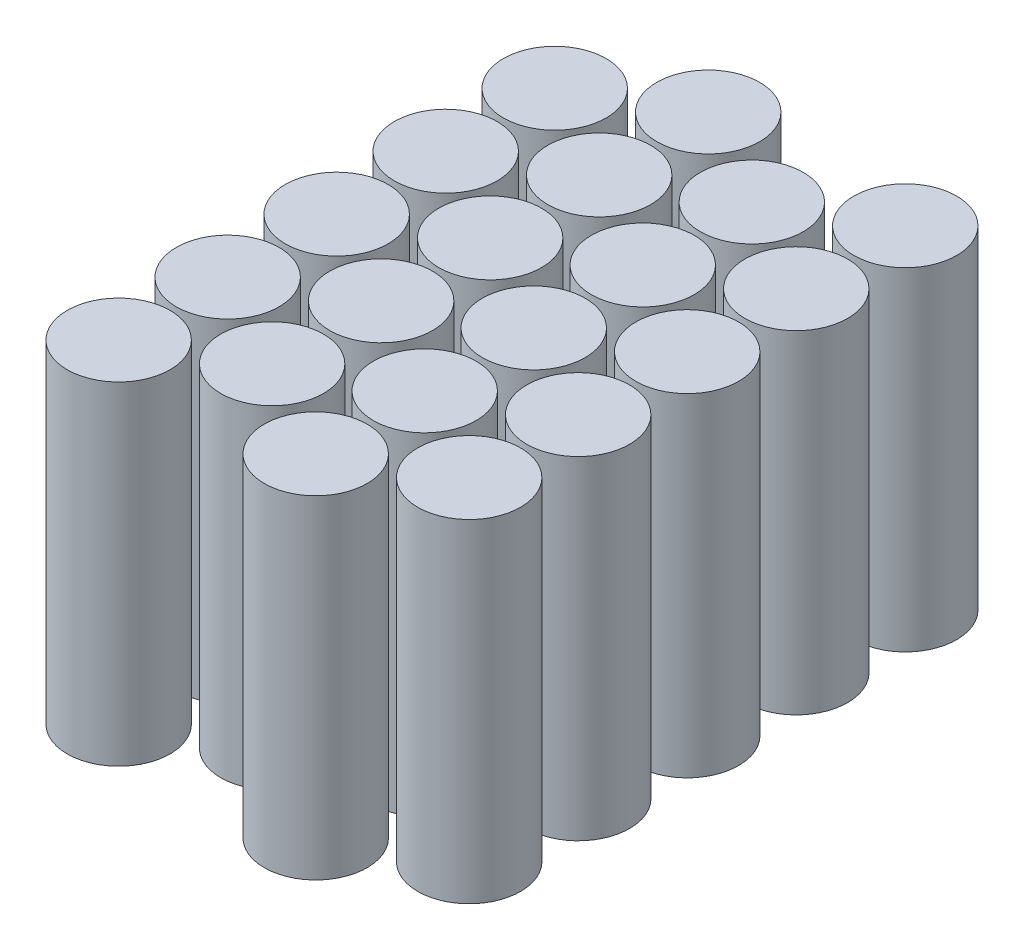
ISO-10303-21;
HEADER;
FILE_DESCRIPTION(('STEP AP214'),'2;1');
FILE_NAME('part.step','',(''),(''),'','','');
FILE_SCHEMA(('AUTOMOTIVE_DESIGN { 1 0 10303 214 1 1 1 1 }'));
ENDSEC;
DATA;
#1=APPLICATION_CONTEXT('core data for automotive mechanical design processes');
#2=APPLICATION_PROTOCOL_DEFINITION('international standard','automotive_design',2000,#1);
#3=PRODUCT_CONTEXT('',#1,'mechanical');
#4=PRODUCT('Part','Part','',(#3));
#5=PRODUCT_RELATED_PRODUCT_CATEGORY('part','',(#4));
#6=PRODUCT_DEFINITION_FORMATION('','',#4);
#7=PRODUCT_DEFINITION_CONTEXT('part definition',#1,'design');
#8=PRODUCT_DEFINITION('design','',#6,#7);
#9=PRODUCT_DEFINITION_SHAPE('','',#8);
#10=(LENGTH_UNIT() NAMED_UNIT(*) SI_UNIT(.MILLI.,.METRE.));
#11=(NAMED_UNIT(*) PLANE_ANGLE_UNIT() SI_UNIT($,.RADIAN.));
#12=(NAMED_UNIT(*) SI_UNIT($,.STERADIAN.) SOLID_ANGLE_UNIT());
#13=UNCERTAINTY_MEASURE_WITH_UNIT(LENGTH_MEASURE(1.E-05),#10,'distance_accuracy_value','');
#14=(GEOMETRIC_REPRESENTATION_CONTEXT(3) GLOBAL_UNCERTAINTY_ASSIGNED_CONTEXT((#13)) GLOBAL_UNIT_ASSIGNED_CONTEXT((#10,
#11,#12)) REPRESENTATION_CONTEXT('',''));
#15=CARTESIAN_POINT('',(0.,0.,0.));
#16=DIRECTION('',(0.,0.,1.));
#17=DIRECTION('',(1.,0.,0.));
#18=AXIS2_PLACEMENT_3D('',#15,#16,#17);
#19=CARTESIAN_POINT('',(62.0948020696912,35.1,80.15));
#20=DIRECTION('',(0.,-1.,0.));
#21=DIRECTION('',(0.,0.,-1.));
#22=AXIS2_PLACEMENT_3D('',#19,#20,#21);
#23=CYLINDRICAL_SURFACE('',#22,10.85);
#24=CARTESIAN_POINT('',(62.0948020696912,35.1,80.15));
#25=DIRECTION('',(0.,1.,0.));
#26=DIRECTION('',(0.,0.,1.));
#27=AXIS2_PLACEMENT_3D('',#24,#25,#26);
#28=CIRCLE('',#27,10.85);
#29=CARTESIAN_POINT('',(62.0948020696912,35.1,91.));
#30=VERTEX_POINT('',#29);
#31=EDGE_CURVE('E61',#30,#30,#28,.T.);
#32=ORIENTED_EDGE('',*,*,#31,.F.);
#33=EDGE_LOOP('',(#32));
#34=FACE_BOUND('',#33,.T.);
#35=CARTESIAN_POINT('',(62.0948020696912,-35.1,80.15));
#36=DIRECTION('',(0.,1.,0.));
#37=DIRECTION('',(0.,0.,1.));
#38=AXIS2_PLACEMENT_3D('',#35,#36,#37);
#39=CIRCLE('',#38,10.85);
#40=CARTESIAN_POINT('',(62.0948020696912,-35.1,91.));
#41=VERTEX_POINT('',#40);
#42=EDGE_CURVE('E12',#41,#41,#39,.T.);
#43=ORIENTED_EDGE('',*,*,#42,.T.);
#44=EDGE_LOOP('',(#43));
#45=FACE_BOUND('',#44,.T.);
#46=ADVANCED_FACE('F57',(#34,#45),#23,.T.);
#47=CARTESIAN_POINT('',(62.0948020696912,35.1,80.15));
#48=DIRECTION('',(0.,1.,0.));
#49=DIRECTION('',(0.,0.,1.));
#50=AXIS2_PLACEMENT_3D('',#47,#48,#49);
#51=PLANE('',#50);
#52=ORIENTED_EDGE('',*,*,#31,.T.);
#53=EDGE_LOOP('',(#52));
#54=FACE_BOUND('',#53,.T.);
#55=ADVANCED_FACE('F59',(#54),#51,.T.);
#56=CARTESIAN_POINT('',(62.0948020696912,-35.1,80.15));
#57=DIRECTION('',(0.,1.,0.));
#58=DIRECTION('',(0.,0.,1.));
#59=AXIS2_PLACEMENT_3D('',#56,#57,#58);
#60=PLANE('',#59);
#61=ORIENTED_EDGE('',*,*,#42,.F.);
#62=EDGE_LOOP('',(#61));
#63=FACE_BOUND('',#62,.T.);
#64=ADVANCED_FACE('F76',(#63),#60,.F.);
#65=CLOSED_SHELL('',(#46,#55,#64));
#66=MANIFOLD_SOLID_BREP('B2',#65);
#67=CARTESIAN_POINT('',(41.57,35.1,92.));
#68=DIRECTION('',(0.,-1.,0.));
#69=DIRECTION('',(0.,0.,-1.));
#70=AXIS2_PLACEMENT_3D('',#67,#68,#69);
#71=CYLINDRICAL_SURFACE('',#70,10.85);
#72=CARTESIAN_POINT('',(41.57,35.1,92.));
#73=DIRECTION('',(0.,1.,0.));
#74=DIRECTION('',(0.,0.,1.));
#75=AXIS2_PLACEMENT_3D('',#72,#73,#74);
#76=CIRCLE('',#75,10.85);
#77=CARTESIAN_POINT('',(41.57,35.1,102.85));
#78=VERTEX_POINT('',#77);
#79=EDGE_CURVE('E56',#78,#78,#76,.T.);
#80=ORIENTED_EDGE('',*,*,#79,.F.);
#81=EDGE_LOOP('',(#80));
#82=FACE_BOUND('',#81,.T.);
#83=CARTESIAN_POINT('',(41.57,-35.1,92.));
#84=DIRECTION('',(0.,1.,0.));
#85=DIRECTION('',(0.,0.,1.));
#86=AXIS2_PLACEMENT_3D('',#83,#84,#85);
#87=CIRCLE('',#86,10.85);
#88=CARTESIAN_POINT('',(41.57,-35.1,102.85));
#89=VERTEX_POINT('',#88);
#90=EDGE_CURVE('E114',#89,#89,#87,.T.);
#91=ORIENTED_EDGE('',*,*,#90,.T.);
#92=EDGE_LOOP('',(#91));
#93=FACE_BOUND('',#92,.T.);
#94=ADVANCED_FACE('F111',(#82,#93),#71,.T.);
#95=CARTESIAN_POINT('',(41.57,35.1,92.));
#96=DIRECTION('',(0.,1.,0.));
#97=DIRECTION('',(0.,0.,1.));
#98=AXIS2_PLACEMENT_3D('',#95,#96,#97);
#99=PLANE('',#98);
#100=ORIENTED_EDGE('',*,*,#79,.T.);
#101=EDGE_LOOP('',(#100));
#102=FACE_BOUND('',#101,.T.);
#103=ADVANCED_FACE('F127',(#102),#99,.T.);
#104=CARTESIAN_POINT('',(41.57,-35.1,92.));
#105=DIRECTION('',(0.,1.,0.));
#106=DIRECTION('',(0.,0.,1.));
#107=AXIS2_PLACEMENT_3D('',#104,#105,#106);
#108=PLANE('',#107);
#109=ORIENTED_EDGE('',*,*,#90,.F.);
#110=EDGE_LOOP('',(#109));
#111=FACE_BOUND('',#110,.T.);
#112=ADVANCED_FACE('F125',(#111),#108,.F.);
#113=CLOSED_SHELL('',(#94,#103,#112));
#114=MANIFOLD_SOLID_BREP('B7',#113);
#115=CARTESIAN_POINT('',(62.0948020696912,35.1,57.1500000000001));
#116=DIRECTION('',(0.,-1.,0.));
#117=DIRECTION('',(0.,0.,-1.));
#118=AXIS2_PLACEMENT_3D('',#115,#116,#117);
#119=CYLINDRICAL_SURFACE('',#118,10.85);
#120=CARTESIAN_POINT('',(62.0948020696912,35.1,57.1500000000001));
#121=DIRECTION('',(0.,1.,0.));
#122=DIRECTION('',(0.,0.,1.));
#123=AXIS2_PLACEMENT_3D('',#120,#121,#122);
#124=CIRCLE('',#123,10.85);
#125=CARTESIAN_POINT('',(62.0948020696912,35.1,68.0000000000001));
#126=VERTEX_POINT('',#125);
#127=EDGE_CURVE('E172',#126,#126,#124,.T.);
#128=ORIENTED_EDGE('',*,*,#127,.F.);
#129=EDGE_LOOP('',(#128));
#130=FACE_BOUND('',#129,.T.);
#131=CARTESIAN_POINT('',(62.0948020696912,-35.1,57.1500000000001));
#132=DIRECTION('',(0.,1.,0.));
#133=DIRECTION('',(0.,0.,1.));
#134=AXIS2_PLACEMENT_3D('',#131,#132,#133);
#135=CIRCLE('',#134,10.85);
#136=CARTESIAN_POINT('',(62.0948020696912,-35.1,68.0000000000001));
#137=VERTEX_POINT('',#136);
#138=EDGE_CURVE('E110',#137,#137,#135,.T.);
#139=ORIENTED_EDGE('',*,*,#138,.T.);
#140=EDGE_LOOP('',(#139));
#141=FACE_BOUND('',#140,.T.);
#142=ADVANCED_FACE('F168',(#130,#141),#119,.T.);
#143=CARTESIAN_POINT('',(62.0948020696912,35.1,57.1500000000001));
#144=DIRECTION('',(0.,1.,0.));
#145=DIRECTION('',(0.,0.,1.));
#146=AXIS2_PLACEMENT_3D('',#143,#144,#145);
#147=PLANE('',#146);
#148=ORIENTED_EDGE('',*,*,#127,.T.);
#149=EDGE_LOOP('',(#148));
#150=FACE_BOUND('',#149,.T.);
#151=ADVANCED_FACE('F170',(#150),#147,.T.);
#152=CARTESIAN_POINT('',(62.0948020696912,-35.1,57.1500000000001));
#153=DIRECTION('',(0.,1.,0.));
#154=DIRECTION('',(0.,0.,1.));
#155=AXIS2_PLACEMENT_3D('',#152,#153,#154);
#156=PLANE('',#155);
#157=ORIENTED_EDGE('',*,*,#138,.F.);
#158=EDGE_LOOP('',(#157));
#159=FACE_BOUND('',#158,.T.);
#160=ADVANCED_FACE('F187',(#159),#156,.F.);
#161=CLOSED_SHELL('',(#142,#151,#160));
#162=MANIFOLD_SOLID_BREP('B51',#161);
#163=CARTESIAN_POINT('',(41.57,35.1,69.));
#164=DIRECTION('',(0.,-1.,0.));
#165=DIRECTION('',(0.,0.,-1.));
#166=AXIS2_PLACEMENT_3D('',#163,#164,#165);
#167=CYLINDRICAL_SURFACE('',#166,10.85);
#168=CARTESIAN_POINT('',(41.57,35.1,69.));
#169=DIRECTION('',(0.,1.,0.));
#170=DIRECTION('',(0.,0.,1.));
#171=AXIS2_PLACEMENT_3D('',#168,#169,#170);
#172=CIRCLE('',#171,10.85);
#173=CARTESIAN_POINT('',(41.57,35.1,79.85));
#174=VERTEX_POINT('',#173);
#175=EDGE_CURVE('E167',#174,#174,#172,.T.);
#176=ORIENTED_EDGE('',*,*,#175,.F.);
#177=EDGE_LOOP('',(#176));
#178=FACE_BOUND('',#177,.T.);
#179=CARTESIAN_POINT('',(41.57,-35.1,69.));
#180=DIRECTION('',(0.,1.,0.));
#181=DIRECTION('',(0.,0.,1.));
#182=AXIS2_PLACEMENT_3D('',#179,#180,#181);
#183=CIRCLE('',#182,10.85);
#184=CARTESIAN_POINT('',(41.57,-35.1,79.85));
#185=VERTEX_POINT('',#184);
#186=EDGE_CURVE('E225',#185,#185,#183,.T.);
#187=ORIENTED_EDGE('',*,*,#186,.T.);
#188=EDGE_LOOP('',(#187));
#189=FACE_BOUND('',#188,.T.);
#190=ADVANCED_FACE('F222',(#178,#189),#167,.T.);
#191=CARTESIAN_POINT('',(41.57,35.1,69.));
#192=DIRECTION('',(0.,1.,0.));
#193=DIRECTION('',(0.,0.,1.));
#194=AXIS2_PLACEMENT_3D('',#191,#192,#193);
#195=PLANE('',#194);
#196=ORIENTED_EDGE('',*,*,#175,.T.);
#197=EDGE_LOOP('',(#196));
#198=FACE_BOUND('',#197,.T.);
#199=ADVANCED_FACE('F239',(#198),#195,.T.);
#200=CARTESIAN_POINT('',(41.57,-35.1,69.));
#201=DIRECTION('',(0.,1.,0.));
#202=DIRECTION('',(0.,0.,1.));
#203=AXIS2_PLACEMENT_3D('',#200,#201,#202);
#204=PLANE('',#203);
#205=ORIENTED_EDGE('',*,*,#186,.F.);
#206=EDGE_LOOP('',(#205));
#207=FACE_BOUND('',#206,.T.);
#208=ADVANCED_FACE('F237',(#207),#204,.F.);
#209=CLOSED_SHELL('',(#190,#199,#208));
#210=MANIFOLD_SOLID_BREP('B105',#209);
#211=CARTESIAN_POINT('',(62.0948020696912,35.1,34.15));
#212=DIRECTION('',(0.,-1.,0.));
#213=DIRECTION('',(0.,0.,-1.));
#214=AXIS2_PLACEMENT_3D('',#211,#212,#213);
#215=CYLINDRICAL_SURFACE('',#214,10.85);
#216=CARTESIAN_POINT('',(62.0948020696912,35.1,34.15));
#217=DIRECTION('',(0.,1.,0.));
#218=DIRECTION('',(0.,0.,1.));
#219=AXIS2_PLACEMENT_3D('',#216,#217,#218);
#220=CIRCLE('',#219,10.85);
#221=CARTESIAN_POINT('',(62.0948020696912,35.1,45.));
#222=VERTEX_POINT('',#221);
#223=EDGE_CURVE('E285',#222,#222,#220,.T.);
#224=ORIENTED_EDGE('',*,*,#223,.F.);
#225=EDGE_LOOP('',(#224));
#226=FACE_BOUND('',#225,.T.);
#227=CARTESIAN_POINT('',(62.0948020696912,-35.1,34.15));
#228=DIRECTION('',(0.,1.,0.));
#229=DIRECTION('',(0.,0.,1.));
#230=AXIS2_PLACEMENT_3D('',#227,#228,#229);
#231=CIRCLE('',#230,10.85);
#232=CARTESIAN_POINT('',(62.0948020696912,-35.1,45.));
#233=VERTEX_POINT('',#232);
#234=EDGE_CURVE('E221',#233,#233,#231,.T.);
#235=ORIENTED_EDGE('',*,*,#234,.T.);
#236=EDGE_LOOP('',(#235));
#237=FACE_BOUND('',#236,.T.);
#238=ADVANCED_FACE('F281',(#226,#237),#215,.T.);
#239=CARTESIAN_POINT('',(62.0948020696912,35.1,34.15));
#240=DIRECTION('',(0.,1.,0.));
#241=DIRECTION('',(0.,0.,1.));
#242=AXIS2_PLACEMENT_3D('',#239,#240,#241);
#243=PLANE('',#242);
#244=ORIENTED_EDGE('',*,*,#223,.T.);
#245=EDGE_LOOP('',(#244));
#246=FACE_BOUND('',#245,.T.);
#247=ADVANCED_FACE('F283',(#246),#243,.T.);
#248=CARTESIAN_POINT('',(62.0948020696912,-35.1,34.15));
#249=DIRECTION('',(0.,1.,0.));
#250=DIRECTION('',(0.,0.,1.));
#251=AXIS2_PLACEMENT_3D('',#248,#249,#250);
#252=PLANE('',#251);
#253=ORIENTED_EDGE('',*,*,#234,.F.);
#254=EDGE_LOOP('',(#253));
#255=FACE_BOUND('',#254,.T.);
#256=ADVANCED_FACE('F300',(#255),#252,.F.);
#257=CLOSED_SHELL('',(#238,#247,#256));
#258=MANIFOLD_SOLID_BREP('B162',#257);
#259=CARTESIAN_POINT('',(41.57,35.1,46.));
#260=DIRECTION('',(0.,-1.,0.));
#261=DIRECTION('',(0.,0.,-1.));
#262=AXIS2_PLACEMENT_3D('',#259,#260,#261);
#263=CYLINDRICAL_SURFACE('',#262,10.85);
#264=CARTESIAN_POINT('',(41.57,35.1,46.));
#265=DIRECTION('',(0.,1.,0.));
#266=DIRECTION('',(0.,0.,1.));
#267=AXIS2_PLACEMENT_3D('',#264,#265,#266);
#268=CIRCLE('',#267,10.85);
#269=CARTESIAN_POINT('',(41.57,35.1,56.85));
#270=VERTEX_POINT('',#269);
#271=EDGE_CURVE('E280',#270,#270,#268,.T.);
#272=ORIENTED_EDGE('',*,*,#271,.F.);
#273=EDGE_LOOP('',(#272));
#274=FACE_BOUND('',#273,.T.);
#275=CARTESIAN_POINT('',(41.57,-35.1,46.));
#276=DIRECTION('',(0.,1.,0.));
#277=DIRECTION('',(0.,0.,1.));
#278=AXIS2_PLACEMENT_3D('',#275,#276,#277);
#279=CIRCLE('',#278,10.85);
#280=CARTESIAN_POINT('',(41.57,-35.1,56.85));
#281=VERTEX_POINT('',#280);
#282=EDGE_CURVE('E338',#281,#281,#279,.T.);
#283=ORIENTED_EDGE('',*,*,#282,.T.);
#284=EDGE_LOOP('',(#283));
#285=FACE_BOUND('',#284,.T.);
#286=ADVANCED_FACE('F335',(#274,#285),#263,.T.);
#287=CARTESIAN_POINT('',(41.57,35.1,46.));
#288=DIRECTION('',(0.,1.,0.));
#289=DIRECTION('',(0.,0.,1.));
#290=AXIS2_PLACEMENT_3D('',#287,#288,#289);
#291=PLANE('',#290);
#292=ORIENTED_EDGE('',*,*,#271,.T.);
#293=EDGE_LOOP('',(#292));
#294=FACE_BOUND('',#293,.T.);
#295=ADVANCED_FACE('F352',(#294),#291,.T.);
#296=CARTESIAN_POINT('',(41.57,-35.1,46.));
#297=DIRECTION('',(0.,1.,0.));
#298=DIRECTION('',(0.,0.,1.));
#299=AXIS2_PLACEMENT_3D('',#296,#297,#298);
#300=PLANE('',#299);
#301=ORIENTED_EDGE('',*,*,#282,.F.);
#302=EDGE_LOOP('',(#301));
#303=FACE_BOUND('',#302,.T.);
#304=ADVANCED_FACE('F350',(#303),#300,.F.);
#305=CLOSED_SHELL('',(#286,#295,#304));
#306=MANIFOLD_SOLID_BREP('B216',#305);
#307=CARTESIAN_POINT('',(62.0948020696912,35.1,11.15));
#308=DIRECTION('',(0.,-1.,0.));
#309=DIRECTION('',(0.,0.,-1.));
#310=AXIS2_PLACEMENT_3D('',#307,#308,#309);
#311=CYLINDRICAL_SURFACE('',#310,10.85);
#312=CARTESIAN_POINT('',(62.0948020696912,35.1,11.15));
#313=DIRECTION('',(0.,1.,0.));
#314=DIRECTION('',(0.,0.,1.));
#315=AXIS2_PLACEMENT_3D('',#312,#313,#314);
#316=CIRCLE('',#315,10.85);
#317=CARTESIAN_POINT('',(62.0948020696912,35.1,22.));
#318=VERTEX_POINT('',#317);
#319=EDGE_CURVE('E395',#318,#318,#316,.T.);
#320=ORIENTED_EDGE('',*,*,#319,.F.);
#321=EDGE_LOOP('',(#320));
#322=FACE_BOUND('',#321,.T.);
#323=CARTESIAN_POINT('',(62.0948020696912,-35.1,11.15));
#324=DIRECTION('',(0.,1.,0.));
#325=DIRECTION('',(0.,0.,1.));
#326=AXIS2_PLACEMENT_3D('',#323,#324,#325);
#327=CIRCLE('',#326,10.85);
#328=CARTESIAN_POINT('',(62.0948020696912,-35.1,22.));
#329=VERTEX_POINT('',#328);
#330=EDGE_CURVE('E334',#329,#329,#327,.T.);
#331=ORIENTED_EDGE('',*,*,#330,.T.);
#332=EDGE_LOOP('',(#331));
#333=FACE_BOUND('',#332,.T.);
#334=ADVANCED_FACE('F391',(#322,#333),#311,.T.);
#335=CARTESIAN_POINT('',(62.0948020696912,35.1,11.15));
#336=DIRECTION('',(0.,1.,0.));
#337=DIRECTION('',(0.,0.,1.));
#338=AXIS2_PLACEMENT_3D('',#335,#336,#337);
#339=PLANE('',#338);
#340=ORIENTED_EDGE('',*,*,#319,.T.);
#341=EDGE_LOOP('',(#340));
#342=FACE_BOUND('',#341,.T.);
#343=ADVANCED_FACE('F393',(#342),#339,.T.);
#344=CARTESIAN_POINT('',(62.0948020696912,-35.1,11.15));
#345=DIRECTION('',(0.,1.,0.));
#346=DIRECTION('',(0.,0.,1.));
#347=AXIS2_PLACEMENT_3D('',#344,#345,#346);
#348=PLANE('',#347);
#349=ORIENTED_EDGE('',*,*,#330,.F.);
#350=EDGE_LOOP('',(#349));
#351=FACE_BOUND('',#350,.T.);
#352=ADVANCED_FACE('F410',(#351),#348,.F.);
#353=CLOSED_SHELL('',(#334,#343,#352));
#354=MANIFOLD_SOLID_BREP('B275',#353);
#355=CARTESIAN_POINT('',(41.57,35.1,23.));
#356=DIRECTION('',(0.,-1.,0.));
#357=DIRECTION('',(0.,0.,-1.));
#358=AXIS2_PLACEMENT_3D('',#355,#356,#357);
#359=CYLINDRICAL_SURFACE('',#358,10.85);
#360=CARTESIAN_POINT('',(41.57,35.1,23.));
#361=DIRECTION('',(0.,1.,0.));
#362=DIRECTION('',(0.,0.,1.));
#363=AXIS2_PLACEMENT_3D('',#360,#361,#362);
#364=CIRCLE('',#363,10.85);
#365=CARTESIAN_POINT('',(41.57,35.1,33.85));
#366=VERTEX_POINT('',#365);
#367=EDGE_CURVE('E390',#366,#366,#364,.T.);
#368=ORIENTED_EDGE('',*,*,#367,.F.);
#369=EDGE_LOOP('',(#368));
#370=FACE_BOUND('',#369,.T.);
#371=CARTESIAN_POINT('',(41.57,-35.1,23.));
#372=DIRECTION('',(0.,1.,0.));
#373=DIRECTION('',(0.,0.,1.));
#374=AXIS2_PLACEMENT_3D('',#371,#372,#373);
#375=CIRCLE('',#374,10.85);
#376=CARTESIAN_POINT('',(41.57,-35.1,33.85));
#377=VERTEX_POINT('',#376);
#378=EDGE_CURVE('E448',#377,#377,#375,.T.);
#379=ORIENTED_EDGE('',*,*,#378,.T.);
#380=EDGE_LOOP('',(#379));
#381=FACE_BOUND('',#380,.T.);
#382=ADVANCED_FACE('F445',(#370,#381),#359,.T.);
#383=CARTESIAN_POINT('',(41.57,35.1,23.));
#384=DIRECTION('',(0.,1.,0.));
#385=DIRECTION('',(0.,0.,1.));
#386=AXIS2_PLACEMENT_3D('',#383,#384,#385);
#387=PLANE('',#386);
#388=ORIENTED_EDGE('',*,*,#367,.T.);
#389=EDGE_LOOP('',(#388));
#390=FACE_BOUND('',#389,.T.);
#391=ADVANCED_FACE('F460',(#390),#387,.T.);
#392=CARTESIAN_POINT('',(41.57,-35.1,23.));
#393=DIRECTION('',(0.,1.,0.));
#394=DIRECTION('',(0.,0.,1.));
#395=AXIS2_PLACEMENT_3D('',#392,#393,#394);
#396=PLANE('',#395);
#397=ORIENTED_EDGE('',*,*,#378,.F.);
#398=EDGE_LOOP('',(#397));
#399=FACE_BOUND('',#398,.T.);
#400=ADVANCED_FACE('F458',(#399),#396,.F.);
#401=CLOSED_SHELL('',(#382,#391,#400));
#402=MANIFOLD_SOLID_BREP('B329',#401);
#403=CARTESIAN_POINT('',(62.0948020696912,35.1,-11.85));
#404=DIRECTION('',(0.,-1.,0.));
#405=DIRECTION('',(0.,0.,-1.));
#406=AXIS2_PLACEMENT_3D('',#403,#404,#405);
#407=CYLINDRICAL_SURFACE('',#406,10.85);
#408=CARTESIAN_POINT('',(62.0948020696912,35.1,-11.85));
#409=DIRECTION('',(0.,1.,0.));
#410=DIRECTION('',(0.,0.,1.));
#411=AXIS2_PLACEMENT_3D('',#408,#409,#410);
#412=CIRCLE('',#411,10.85);
#413=CARTESIAN_POINT('',(62.0948020696912,35.1,-0.999999999999952));
#414=VERTEX_POINT('',#413);
#415=EDGE_CURVE('E503',#414,#414,#412,.T.);
#416=ORIENTED_EDGE('',*,*,#415,.F.);
#417=EDGE_LOOP('',(#416));
#418=FACE_BOUND('',#417,.T.);
#419=CARTESIAN_POINT('',(62.0948020696912,-35.1,-11.85));
#420=DIRECTION('',(0.,1.,0.));
#421=DIRECTION('',(0.,0.,1.));
#422=AXIS2_PLACEMENT_3D('',#419,#420,#421);
#423=CIRCLE('',#422,10.85);
#424=CARTESIAN_POINT('',(62.0948020696912,-35.1,-0.999999999999952));
#425=VERTEX_POINT('',#424);
#426=EDGE_CURVE('E444',#425,#425,#423,.T.);
#427=ORIENTED_EDGE('',*,*,#426,.T.);
#428=EDGE_LOOP('',(#427));
#429=FACE_BOUND('',#428,.T.);
#430=ADVANCED_FACE('F499',(#418,#429),#407,.T.);
#431=CARTESIAN_POINT('',(62.0948020696912,35.1,-11.85));
#432=DIRECTION('',(0.,1.,0.));
#433=DIRECTION('',(0.,0.,1.));
#434=AXIS2_PLACEMENT_3D('',#431,#432,#433);
#435=PLANE('',#434);
#436=ORIENTED_EDGE('',*,*,#415,.T.);
#437=EDGE_LOOP('',(#436));
#438=FACE_BOUND('',#437,.T.);
#439=ADVANCED_FACE('F501',(#438),#435,.T.);
#440=CARTESIAN_POINT('',(62.0948020696912,-35.1,-11.85));
#441=DIRECTION('',(0.,1.,0.));
#442=DIRECTION('',(0.,0.,1.));
#443=AXIS2_PLACEMENT_3D('',#440,#441,#442);
#444=PLANE('',#443);
#445=ORIENTED_EDGE('',*,*,#426,.F.);
#446=EDGE_LOOP('',(#445));
#447=FACE_BOUND('',#446,.T.);
#448=ADVANCED_FACE('F518',(#447),#444,.F.);
#449=CLOSED_SHELL('',(#430,#439,#448));
#450=MANIFOLD_SOLID_BREP('B385',#449);
#451=CARTESIAN_POINT('',(41.57,35.1,0.));
#452=DIRECTION('',(0.,-1.,0.));
#453=DIRECTION('',(0.,0.,-1.));
#454=AXIS2_PLACEMENT_3D('',#451,#452,#453);
#455=CYLINDRICAL_SURFACE('',#454,10.85);
#456=CARTESIAN_POINT('',(41.57,35.1,0.));
#457=DIRECTION('',(0.,1.,0.));
#458=DIRECTION('',(0.,0.,1.));
#459=AXIS2_PLACEMENT_3D('',#456,#457,#458);
#460=CIRCLE('',#459,10.85);
#461=CARTESIAN_POINT('',(41.57,35.1,10.85));
#462=VERTEX_POINT('',#461);
#463=EDGE_CURVE('E498',#462,#462,#460,.T.);
#464=ORIENTED_EDGE('',*,*,#463,.F.);
#465=EDGE_LOOP('',(#464));
#466=FACE_BOUND('',#465,.T.);
#467=CARTESIAN_POINT('',(41.57,-35.1,0.));
#468=DIRECTION('',(0.,1.,0.));
#469=DIRECTION('',(0.,0.,1.));
#470=AXIS2_PLACEMENT_3D('',#467,#468,#469);
#471=CIRCLE('',#470,10.85);
#472=CARTESIAN_POINT('',(41.57,-35.1,10.85));
#473=VERTEX_POINT('',#472);
#474=EDGE_CURVE('E556',#473,#473,#471,.T.);
#475=ORIENTED_EDGE('',*,*,#474,.T.);
#476=EDGE_LOOP('',(#475));
#477=FACE_BOUND('',#476,.T.);
#478=ADVANCED_FACE('F553',(#466,#477),#455,.T.);
#479=CARTESIAN_POINT('',(41.57,35.1,0.));
#480=DIRECTION('',(0.,1.,0.));
#481=DIRECTION('',(0.,0.,1.));
#482=AXIS2_PLACEMENT_3D('',#479,#480,#481);
#483=PLANE('',#482);
#484=ORIENTED_EDGE('',*,*,#463,.T.);
#485=EDGE_LOOP('',(#484));
#486=FACE_BOUND('',#485,.T.);
#487=ADVANCED_FACE('F569',(#486),#483,.T.);
#488=CARTESIAN_POINT('',(41.57,-35.1,0.));
#489=DIRECTION('',(0.,1.,0.));
#490=DIRECTION('',(0.,0.,1.));
#491=AXIS2_PLACEMENT_3D('',#488,#489,#490);
#492=PLANE('',#491);
#493=ORIENTED_EDGE('',*,*,#474,.F.);
#494=EDGE_LOOP('',(#493));
#495=FACE_BOUND('',#494,.T.);
#496=ADVANCED_FACE('F567',(#495),#492,.F.);
#497=CLOSED_SHELL('',(#478,#487,#496));
#498=MANIFOLD_SOLID_BREP('B439',#497);
#499=CARTESIAN_POINT('',(20.5248020696912,35.1,80.15));
#500=DIRECTION('',(0.,-1.,0.));
#501=DIRECTION('',(0.,0.,-1.));
#502=AXIS2_PLACEMENT_3D('',#499,#500,#501);
#503=CYLINDRICAL_SURFACE('',#502,10.85);
#504=CARTESIAN_POINT('',(20.5248020696912,35.1,80.15));
#505=DIRECTION('',(0.,1.,0.));
#506=DIRECTION('',(0.,0.,1.));
#507=AXIS2_PLACEMENT_3D('',#504,#505,#506);
#508=CIRCLE('',#507,10.85);
#509=CARTESIAN_POINT('',(20.5248020696912,35.1,91.));
#510=VERTEX_POINT('',#509);
#511=EDGE_CURVE('E614',#510,#510,#508,.T.);
#512=ORIENTED_EDGE('',*,*,#511,.F.);
#513=EDGE_LOOP('',(#512));
#514=FACE_BOUND('',#513,.T.);
#515=CARTESIAN_POINT('',(20.5248020696912,-35.1,80.15));
#516=DIRECTION('',(0.,1.,0.));
#517=DIRECTION('',(0.,0.,1.));
#518=AXIS2_PLACEMENT_3D('',#515,#516,#517);
#519=CIRCLE('',#518,10.85);
#520=CARTESIAN_POINT('',(20.5248020696912,-35.1,91.));
#521=VERTEX_POINT('',#520);
#522=EDGE_CURVE('E552',#521,#521,#519,.T.);
#523=ORIENTED_EDGE('',*,*,#522,.T.);
#524=EDGE_LOOP('',(#523));
#525=FACE_BOUND('',#524,.T.);
#526=ADVANCED_FACE('F610',(#514,#525),#503,.T.);
#527=CARTESIAN_POINT('',(20.5248020696912,35.1,80.15));
#528=DIRECTION('',(0.,1.,0.));
#529=DIRECTION('',(0.,0.,1.));
#530=AXIS2_PLACEMENT_3D('',#527,#528,#529);
#531=PLANE('',#530);
#532=ORIENTED_EDGE('',*,*,#511,.T.);
#533=EDGE_LOOP('',(#532));
#534=FACE_BOUND('',#533,.T.);
#535=ADVANCED_FACE('F612',(#534),#531,.T.);
#536=CARTESIAN_POINT('',(20.5248020696912,-35.1,80.15));
#537=DIRECTION('',(0.,1.,0.));
#538=DIRECTION('',(0.,0.,1.));
#539=AXIS2_PLACEMENT_3D('',#536,#537,#538);
#540=PLANE('',#539);
#541=ORIENTED_EDGE('',*,*,#522,.F.);
#542=EDGE_LOOP('',(#541));
#543=FACE_BOUND('',#542,.T.);
#544=ADVANCED_FACE('F630',(#543),#540,.F.);
#545=CLOSED_SHELL('',(#526,#535,#544));
#546=MANIFOLD_SOLID_BREP('B493',#545);
#547=CARTESIAN_POINT('',(20.5248020696912,35.1,57.1500000000001));
#548=DIRECTION('',(0.,-1.,0.));
#549=DIRECTION('',(0.,0.,-1.));
#550=AXIS2_PLACEMENT_3D('',#547,#548,#549);
#551=CYLINDRICAL_SURFACE('',#550,10.85);
#552=CARTESIAN_POINT('',(20.5248020696912,35.1,57.1500000000001));
#553=DIRECTION('',(0.,1.,0.));
#554=DIRECTION('',(0.,0.,1.));
#555=AXIS2_PLACEMENT_3D('',#552,#553,#554);
#556=CIRCLE('',#555,10.85);
#557=CARTESIAN_POINT('',(20.5248020696912,35.1,68.0000000000001));
#558=VERTEX_POINT('',#557);
#559=EDGE_CURVE('E672',#558,#558,#556,.T.);
#560=ORIENTED_EDGE('',*,*,#559,.F.);
#561=EDGE_LOOP('',(#560));
#562=FACE_BOUND('',#561,.T.);
#563=CARTESIAN_POINT('',(20.5248020696912,-35.1,57.1500000000001));
#564=DIRECTION('',(0.,1.,0.));
#565=DIRECTION('',(0.,0.,1.));
#566=AXIS2_PLACEMENT_3D('',#563,#564,#565);
#567=CIRCLE('',#566,10.85);
#568=CARTESIAN_POINT('',(20.5248020696912,-35.1,68.0000000000001));
#569=VERTEX_POINT('',#568);
#570=EDGE_CURVE('E609',#569,#569,#567,.T.);
#571=ORIENTED_EDGE('',*,*,#570,.T.);
#572=EDGE_LOOP('',(#571));
#573=FACE_BOUND('',#572,.T.);
#574=ADVANCED_FACE('F668',(#562,#573),#551,.T.);
#575=CARTESIAN_POINT('',(20.5248020696912,35.1,57.1500000000001));
#576=DIRECTION('',(0.,1.,0.));
#577=DIRECTION('',(0.,0.,1.));
#578=AXIS2_PLACEMENT_3D('',#575,#576,#577);
#579=PLANE('',#578);
#580=ORIENTED_EDGE('',*,*,#559,.T.);
#581=EDGE_LOOP('',(#580));
#582=FACE_BOUND('',#581,.T.);
#583=ADVANCED_FACE('F670',(#582),#579,.T.);
#584=CARTESIAN_POINT('',(20.5248020696912,-35.1,57.1500000000001));
#585=DIRECTION('',(0.,1.,0.));
#586=DIRECTION('',(0.,0.,1.));
#587=AXIS2_PLACEMENT_3D('',#584,#585,#586);
#588=PLANE('',#587);
#589=ORIENTED_EDGE('',*,*,#570,.F.);
#590=EDGE_LOOP('',(#589));
#591=FACE_BOUND('',#590,.T.);
#592=ADVANCED_FACE('F688',(#591),#588,.F.);
#593=CLOSED_SHELL('',(#574,#583,#592));
#594=MANIFOLD_SOLID_BREP('B547',#593);
#595=CARTESIAN_POINT('',(20.5248020696912,35.1,34.15));
#596=DIRECTION('',(0.,-1.,0.));
#597=DIRECTION('',(0.,0.,-1.));
#598=AXIS2_PLACEMENT_3D('',#595,#596,#597);
#599=CYLINDRICAL_SURFACE('',#598,10.85);
#600=CARTESIAN_POINT('',(20.5248020696912,35.1,34.15));
#601=DIRECTION('',(0.,1.,0.));
#602=DIRECTION('',(0.,0.,1.));
#603=AXIS2_PLACEMENT_3D('',#600,#601,#602);
#604=CIRCLE('',#603,10.85);
#605=CARTESIAN_POINT('',(20.5248020696912,35.1,45.));
#606=VERTEX_POINT('',#605);
#607=EDGE_CURVE('E727',#606,#606,#604,.T.);
#608=ORIENTED_EDGE('',*,*,#607,.F.);
#609=EDGE_LOOP('',(#608));
#610=FACE_BOUND('',#609,.T.);
#611=CARTESIAN_POINT('',(20.5248020696912,-35.1,34.15));
#612=DIRECTION('',(0.,1.,0.));
#613=DIRECTION('',(0.,0.,1.));
#614=AXIS2_PLACEMENT_3D('',#611,#612,#613);
#615=CIRCLE('',#614,10.85);
#616=CARTESIAN_POINT('',(20.5248020696912,-35.1,45.));
#617=VERTEX_POINT('',#616);
#618=EDGE_CURVE('E667',#617,#617,#615,.T.);
#619=ORIENTED_EDGE('',*,*,#618,.T.);
#620=EDGE_LOOP('',(#619));
#621=FACE_BOUND('',#620,.T.);
#622=ADVANCED_FACE('F723',(#610,#621),#599,.T.);
#623=CARTESIAN_POINT('',(20.5248020696912,35.1,34.15));
#624=DIRECTION('',(0.,1.,0.));
#625=DIRECTION('',(0.,0.,1.));
#626=AXIS2_PLACEMENT_3D('',#623,#624,#625);
#627=PLANE('',#626);
#628=ORIENTED_EDGE('',*,*,#607,.T.);
#629=EDGE_LOOP('',(#628));
#630=FACE_BOUND('',#629,.T.);
#631=ADVANCED_FACE('F725',(#630),#627,.T.);
#632=CARTESIAN_POINT('',(20.5248020696912,-35.1,34.15));
#633=DIRECTION('',(0.,1.,0.));
#634=DIRECTION('',(0.,0.,1.));
#635=AXIS2_PLACEMENT_3D('',#632,#633,#634);
#636=PLANE('',#635);
#637=ORIENTED_EDGE('',*,*,#618,.F.);
#638=EDGE_LOOP('',(#637));
#639=FACE_BOUND('',#638,.T.);
#640=ADVANCED_FACE('F742',(#639),#636,.F.);
#641=CLOSED_SHELL('',(#622,#631,#640));
#642=MANIFOLD_SOLID_BREP('B604',#641);
#643=CARTESIAN_POINT('',(20.5248020696912,35.1,11.15));
#644=DIRECTION('',(0.,-1.,0.));
#645=DIRECTION('',(0.,0.,-1.));
#646=AXIS2_PLACEMENT_3D('',#643,#644,#645);
#647=CYLINDRICAL_SURFACE('',#646,10.85);
#648=CARTESIAN_POINT('',(20.5248020696912,35.1,11.15));
#649=DIRECTION('',(0.,1.,0.));
#650=DIRECTION('',(0.,0.,1.));
#651=AXIS2_PLACEMENT_3D('',#648,#649,#650);
#652=CIRCLE('',#651,10.85);
#653=CARTESIAN_POINT('',(20.5248020696912,35.1,22.));
#654=VERTEX_POINT('',#653);
#655=EDGE_CURVE('E781',#654,#654,#652,.T.);
#656=ORIENTED_EDGE('',*,*,#655,.F.);
#657=EDGE_LOOP('',(#656));
#658=FACE_BOUND('',#657,.T.);
#659=CARTESIAN_POINT('',(20.5248020696912,-35.1,11.15));
#660=DIRECTION('',(0.,1.,0.));
#661=DIRECTION('',(0.,0.,1.));
#662=AXIS2_PLACEMENT_3D('',#659,#660,#661);
#663=CIRCLE('',#662,10.85);
#664=CARTESIAN_POINT('',(20.5248020696912,-35.1,22.));
#665=VERTEX_POINT('',#664);
#666=EDGE_CURVE('E722',#665,#665,#663,.T.);
#667=ORIENTED_EDGE('',*,*,#666,.T.);
#668=EDGE_LOOP('',(#667));
#669=FACE_BOUND('',#668,.T.);
#670=ADVANCED_FACE('F777',(#658,#669),#647,.T.);
#671=CARTESIAN_POINT('',(20.5248020696912,35.1,11.15));
#672=DIRECTION('',(0.,1.,0.));
#673=DIRECTION('',(0.,0.,1.));
#674=AXIS2_PLACEMENT_3D('',#671,#672,#673);
#675=PLANE('',#674);
#676=ORIENTED_EDGE('',*,*,#655,.T.);
#677=EDGE_LOOP('',(#676));
#678=FACE_BOUND('',#677,.T.);
#679=ADVANCED_FACE('F779',(#678),#675,.T.);
#680=CARTESIAN_POINT('',(20.5248020696912,-35.1,11.15));
#681=DIRECTION('',(0.,1.,0.));
#682=DIRECTION('',(0.,0.,1.));
#683=AXIS2_PLACEMENT_3D('',#680,#681,#682);
#684=PLANE('',#683);
#685=ORIENTED_EDGE('',*,*,#666,.F.);
#686=EDGE_LOOP('',(#685));
#687=FACE_BOUND('',#686,.T.);
#688=ADVANCED_FACE('F797',(#687),#684,.F.);
#689=CLOSED_SHELL('',(#670,#679,#688));
#690=MANIFOLD_SOLID_BREP('B662',#689);
#691=CARTESIAN_POINT('',(0.,35.1,92.));
#692=DIRECTION('',(0.,-1.,0.));
#693=DIRECTION('',(0.,0.,-1.));
#694=AXIS2_PLACEMENT_3D('',#691,#692,#693);
#695=CYLINDRICAL_SURFACE('',#694,10.85);
#696=CARTESIAN_POINT('',(0.,35.1,92.));
#697=DIRECTION('',(0.,1.,0.));
#698=DIRECTION('',(0.,0.,1.));
#699=AXIS2_PLACEMENT_3D('',#696,#697,#698);
#700=CIRCLE('',#699,10.85);
#701=CARTESIAN_POINT('',(0.,35.1,102.85));
#702=VERTEX_POINT('',#701);
#703=EDGE_CURVE('E776',#702,#702,#700,.T.);
#704=ORIENTED_EDGE('',*,*,#703,.F.);
#705=EDGE_LOOP('',(#704));
#706=FACE_BOUND('',#705,.T.);
#707=CARTESIAN_POINT('',(0.,-35.1,92.));
#708=DIRECTION('',(0.,1.,0.));
#709=DIRECTION('',(0.,0.,1.));
#710=AXIS2_PLACEMENT_3D('',#707,#708,#709);
#711=CIRCLE('',#710,10.85);
#712=CARTESIAN_POINT('',(0.,-35.1,102.85));
#713=VERTEX_POINT('',#712);
#714=EDGE_CURVE('E837',#713,#713,#711,.T.);
#715=ORIENTED_EDGE('',*,*,#714,.T.);
#716=EDGE_LOOP('',(#715));
#717=FACE_BOUND('',#716,.T.);
#718=ADVANCED_FACE('F834',(#706,#717),#695,.T.);
#719=CARTESIAN_POINT('',(0.,35.1,92.));
#720=DIRECTION('',(0.,1.,0.));
#721=DIRECTION('',(0.,0.,1.));
#722=AXIS2_PLACEMENT_3D('',#719,#720,#721);
#723=PLANE('',#722);
#724=ORIENTED_EDGE('',*,*,#703,.T.);
#725=EDGE_LOOP('',(#724));
#726=FACE_BOUND('',#725,.T.);
#727=ADVANCED_FACE('F849',(#726),#723,.T.);
#728=CARTESIAN_POINT('',(0.,-35.1,92.));
#729=DIRECTION('',(0.,1.,0.));
#730=DIRECTION('',(0.,0.,1.));
#731=AXIS2_PLACEMENT_3D('',#728,#729,#730);
#732=PLANE('',#731);
#733=ORIENTED_EDGE('',*,*,#714,.F.);
#734=EDGE_LOOP('',(#733));
#735=FACE_BOUND('',#734,.T.);
#736=ADVANCED_FACE('F847',(#735),#732,.F.);
#737=CLOSED_SHELL('',(#718,#727,#736));
#738=MANIFOLD_SOLID_BREP('B717',#737);
#739=CARTESIAN_POINT('',(0.,35.1,69.));
#740=DIRECTION('',(0.,-1.,0.));
#741=DIRECTION('',(0.,0.,-1.));
#742=AXIS2_PLACEMENT_3D('',#739,#740,#741);
#743=CYLINDRICAL_SURFACE('',#742,10.85);
#744=CARTESIAN_POINT('',(0.,35.1,69.));
#745=DIRECTION('',(0.,1.,0.));
#746=DIRECTION('',(0.,0.,1.));
#747=AXIS2_PLACEMENT_3D('',#744,#745,#746);
#748=CIRCLE('',#747,10.85);
#749=CARTESIAN_POINT('',(0.,35.1,79.85));
#750=VERTEX_POINT('',#749);
#751=EDGE_CURVE('E833',#750,#750,#748,.T.);
#752=ORIENTED_EDGE('',*,*,#751,.F.);
#753=EDGE_LOOP('',(#752));
#754=FACE_BOUND('',#753,.T.);
#755=CARTESIAN_POINT('',(0.,-35.1,69.));
#756=DIRECTION('',(0.,1.,0.));
#757=DIRECTION('',(0.,0.,1.));
#758=AXIS2_PLACEMENT_3D('',#755,#756,#757);
#759=CIRCLE('',#758,10.85);
#760=CARTESIAN_POINT('',(0.,-35.1,79.85));
#761=VERTEX_POINT('',#760);
#762=EDGE_CURVE('E891',#761,#761,#759,.T.);
#763=ORIENTED_EDGE('',*,*,#762,.T.);
#764=EDGE_LOOP('',(#763));
#765=FACE_BOUND('',#764,.T.);
#766=ADVANCED_FACE('F888',(#754,#765),#743,.T.);
#767=CARTESIAN_POINT('',(0.,35.1,69.));
#768=DIRECTION('',(0.,1.,0.));
#769=DIRECTION('',(0.,0.,1.));
#770=AXIS2_PLACEMENT_3D('',#767,#768,#769);
#771=PLANE('',#770);
#772=ORIENTED_EDGE('',*,*,#751,.T.);
#773=EDGE_LOOP('',(#772));
#774=FACE_BOUND('',#773,.T.);
#775=ADVANCED_FACE('F903',(#774),#771,.T.);
#776=CARTESIAN_POINT('',(0.,-35.1,69.));
#777=DIRECTION('',(0.,1.,0.));
#778=DIRECTION('',(0.,0.,1.));
#779=AXIS2_PLACEMENT_3D('',#776,#777,#778);
#780=PLANE('',#779);
#781=ORIENTED_EDGE('',*,*,#762,.F.);
#782=EDGE_LOOP('',(#781));
#783=FACE_BOUND('',#782,.T.);
#784=ADVANCED_FACE('F901',(#783),#780,.F.);
#785=CLOSED_SHELL('',(#766,#775,#784));
#786=MANIFOLD_SOLID_BREP('B771',#785);
#787=CARTESIAN_POINT('',(0.,35.1,46.));
#788=DIRECTION('',(0.,-1.,0.));
#789=DIRECTION('',(0.,0.,-1.));
#790=AXIS2_PLACEMENT_3D('',#787,#788,#789);
#791=CYLINDRICAL_SURFACE('',#790,10.85);
#792=CARTESIAN_POINT('',(0.,35.1,46.));
#793=DIRECTION('',(0.,1.,0.));
#794=DIRECTION('',(0.,0.,1.));
#795=AXIS2_PLACEMENT_3D('',#792,#793,#794);
#796=CIRCLE('',#795,10.85);
#797=CARTESIAN_POINT('',(0.,35.1,56.85));
#798=VERTEX_POINT('',#797);
#799=EDGE_CURVE('E887',#798,#798,#796,.T.);
#800=ORIENTED_EDGE('',*,*,#799,.F.);
#801=EDGE_LOOP('',(#800));
#802=FACE_BOUND('',#801,.T.);
#803=CARTESIAN_POINT('',(0.,-35.1,46.));
#804=DIRECTION('',(0.,1.,0.));
#805=DIRECTION('',(0.,0.,1.));
#806=AXIS2_PLACEMENT_3D('',#803,#804,#805);
#807=CIRCLE('',#806,10.85);
#808=CARTESIAN_POINT('',(0.,-35.1,56.85));
#809=VERTEX_POINT('',#808);
#810=EDGE_CURVE('E947',#809,#809,#807,.T.);
#811=ORIENTED_EDGE('',*,*,#810,.T.);
#812=EDGE_LOOP('',(#811));
#813=FACE_BOUND('',#812,.T.);
#814=ADVANCED_FACE('F944',(#802,#813),#791,.T.);
#815=CARTESIAN_POINT('',(0.,35.1,46.));
#816=DIRECTION('',(0.,1.,0.));
#817=DIRECTION('',(0.,0.,1.));
#818=AXIS2_PLACEMENT_3D('',#815,#816,#817);
#819=PLANE('',#818);
#820=ORIENTED_EDGE('',*,*,#799,.T.);
#821=EDGE_LOOP('',(#820));
#822=FACE_BOUND('',#821,.T.);
#823=ADVANCED_FACE('F959',(#822),#819,.T.);
#824=CARTESIAN_POINT('',(0.,-35.1,46.));
#825=DIRECTION('',(0.,1.,0.));
#826=DIRECTION('',(0.,0.,1.));
#827=AXIS2_PLACEMENT_3D('',#824,#825,#826);
#828=PLANE('',#827);
#829=ORIENTED_EDGE('',*,*,#810,.F.);
#830=EDGE_LOOP('',(#829));
#831=FACE_BOUND('',#830,.T.);
#832=ADVANCED_FACE('F957',(#831),#828,.F.);
#833=CLOSED_SHELL('',(#814,#823,#832));
#834=MANIFOLD_SOLID_BREP('B828',#833);
#835=CARTESIAN_POINT('',(0.,35.1,23.));
#836=DIRECTION('',(0.,-1.,0.));
#837=DIRECTION('',(0.,0.,-1.));
#838=AXIS2_PLACEMENT_3D('',#835,#836,#837);
#839=CYLINDRICAL_SURFACE('',#838,10.85);
#840=CARTESIAN_POINT('',(0.,35.1,23.));
#841=DIRECTION('',(0.,1.,0.));
#842=DIRECTION('',(0.,0.,1.));
#843=AXIS2_PLACEMENT_3D('',#840,#841,#842);
#844=CIRCLE('',#843,10.85);
#845=CARTESIAN_POINT('',(0.,35.1,33.85));
#846=VERTEX_POINT('',#845);
#847=EDGE_CURVE('E943',#846,#846,#844,.T.);
#848=ORIENTED_EDGE('',*,*,#847,.F.);
#849=EDGE_LOOP('',(#848));
#850=FACE_BOUND('',#849,.T.);
#851=CARTESIAN_POINT('',(0.,-35.1,23.));
#852=DIRECTION('',(0.,1.,0.));
#853=DIRECTION('',(0.,0.,1.));
#854=AXIS2_PLACEMENT_3D('',#851,#852,#853);
#855=CIRCLE('',#854,10.85);
#856=CARTESIAN_POINT('',(0.,-35.1,33.85));
#857=VERTEX_POINT('',#856);
#858=EDGE_CURVE('E1001',#857,#857,#855,.T.);
#859=ORIENTED_EDGE('',*,*,#858,.T.);
#860=EDGE_LOOP('',(#859));
#861=FACE_BOUND('',#860,.T.);
#862=ADVANCED_FACE('F998',(#850,#861),#839,.T.);
#863=CARTESIAN_POINT('',(0.,35.1,23.));
#864=DIRECTION('',(0.,1.,0.));
#865=DIRECTION('',(0.,0.,1.));
#866=AXIS2_PLACEMENT_3D('',#863,#864,#865);
#867=PLANE('',#866);
#868=ORIENTED_EDGE('',*,*,#847,.T.);
#869=EDGE_LOOP('',(#868));
#870=FACE_BOUND('',#869,.T.);
#871=ADVANCED_FACE('F1013',(#870),#867,.T.);
#872=CARTESIAN_POINT('',(0.,-35.1,23.));
#873=DIRECTION('',(0.,1.,0.));
#874=DIRECTION('',(0.,0.,1.));
#875=AXIS2_PLACEMENT_3D('',#872,#873,#874);
#876=PLANE('',#875);
#877=ORIENTED_EDGE('',*,*,#858,.F.);
#878=EDGE_LOOP('',(#877));
#879=FACE_BOUND('',#878,.T.);
#880=ADVANCED_FACE('F1011',(#879),#876,.F.);
#881=CLOSED_SHELL('',(#862,#871,#880));
#882=MANIFOLD_SOLID_BREP('B882',#881);
#883=CARTESIAN_POINT('',(20.5248020696912,35.1,-11.85));
#884=DIRECTION('',(0.,-1.,0.));
#885=DIRECTION('',(0.,0.,-1.));
#886=AXIS2_PLACEMENT_3D('',#883,#884,#885);
#887=CYLINDRICAL_SURFACE('',#886,10.85);
#888=CARTESIAN_POINT('',(20.5248020696912,35.1,-11.85));
#889=DIRECTION('',(0.,1.,0.));
#890=DIRECTION('',(0.,0.,1.));
#891=AXIS2_PLACEMENT_3D('',#888,#889,#890);
#892=CIRCLE('',#891,10.85);
#893=CARTESIAN_POINT('',(20.5248020696912,35.1,-0.999999999999952));
#894=VERTEX_POINT('',#893);
#895=EDGE_CURVE('E1055',#894,#894,#892,.T.);
#896=ORIENTED_EDGE('',*,*,#895,.F.);
#897=EDGE_LOOP('',(#896));
#898=FACE_BOUND('',#897,.T.);
#899=CARTESIAN_POINT('',(20.5248020696912,-35.1,-11.85));
#900=DIRECTION('',(0.,1.,0.));
#901=DIRECTION('',(0.,0.,1.));
#902=AXIS2_PLACEMENT_3D('',#899,#900,#901);
#903=CIRCLE('',#902,10.85);
#904=CARTESIAN_POINT('',(20.5248020696912,-35.1,-0.999999999999952));
#905=VERTEX_POINT('',#904);
#906=EDGE_CURVE('E997',#905,#905,#903,.T.);
#907=ORIENTED_EDGE('',*,*,#906,.T.);
#908=EDGE_LOOP('',(#907));
#909=FACE_BOUND('',#908,.T.);
#910=ADVANCED_FACE('F1051',(#898,#909),#887,.T.);
#911=CARTESIAN_POINT('',(20.5248020696912,35.1,-11.85));
#912=DIRECTION('',(0.,1.,0.));
#913=DIRECTION('',(0.,0.,1.));
#914=AXIS2_PLACEMENT_3D('',#911,#912,#913);
#915=PLANE('',#914);
#916=ORIENTED_EDGE('',*,*,#895,.T.);
#917=EDGE_LOOP('',(#916));
#918=FACE_BOUND('',#917,.T.);
#919=ADVANCED_FACE('F1053',(#918),#915,.T.);
#920=CARTESIAN_POINT('',(20.5248020696912,-35.1,-11.85));
#921=DIRECTION('',(0.,1.,0.));
#922=DIRECTION('',(0.,0.,1.));
#923=AXIS2_PLACEMENT_3D('',#920,#921,#922);
#924=PLANE('',#923);
#925=ORIENTED_EDGE('',*,*,#906,.F.);
#926=EDGE_LOOP('',(#925));
#927=FACE_BOUND('',#926,.T.);
#928=ADVANCED_FACE('F1071',(#927),#924,.F.);
#929=CLOSED_SHELL('',(#910,#919,#928));
#930=MANIFOLD_SOLID_BREP('B938',#929);
#931=CARTESIAN_POINT('',(0.,35.1,0.));
#932=DIRECTION('',(0.,-1.,0.));
#933=DIRECTION('',(0.,0.,-1.));
#934=AXIS2_PLACEMENT_3D('',#931,#932,#933);
#935=CYLINDRICAL_SURFACE('',#934,10.85);
#936=CARTESIAN_POINT('',(0.,35.1,0.));
#937=DIRECTION('',(0.,1.,0.));
#938=DIRECTION('',(0.,0.,1.));
#939=AXIS2_PLACEMENT_3D('',#936,#937,#938);
#940=CIRCLE('',#939,10.85);
#941=CARTESIAN_POINT('',(0.,35.1,10.85));
#942=VERTEX_POINT('',#941);
#943=EDGE_CURVE('E1050',#942,#942,#940,.T.);
#944=ORIENTED_EDGE('',*,*,#943,.F.);
#945=EDGE_LOOP('',(#944));
#946=FACE_BOUND('',#945,.T.);
#947=CARTESIAN_POINT('',(0.,-35.1,0.));
#948=DIRECTION('',(0.,1.,0.));
#949=DIRECTION('',(0.,0.,1.));
#950=AXIS2_PLACEMENT_3D('',#947,#948,#949);
#951=CIRCLE('',#950,10.85);
#952=CARTESIAN_POINT('',(0.,-35.1,10.85));
#953=VERTEX_POINT('',#952);
#954=EDGE_CURVE('E1103',#953,#953,#951,.T.);
#955=ORIENTED_EDGE('',*,*,#954,.T.);
#956=EDGE_LOOP('',(#955));
#957=FACE_BOUND('',#956,.T.);
#958=ADVANCED_FACE('F1100',(#946,#957),#935,.T.);
#959=CARTESIAN_POINT('',(0.,35.1,0.));
#960=DIRECTION('',(0.,1.,0.));
#961=DIRECTION('',(0.,0.,1.));
#962=AXIS2_PLACEMENT_3D('',#959,#960,#961);
#963=PLANE('',#962);
#964=ORIENTED_EDGE('',*,*,#943,.T.);
#965=EDGE_LOOP('',(#964));
#966=FACE_BOUND('',#965,.T.);
#967=ADVANCED_FACE('F1117',(#966),#963,.T.);
#968=CARTESIAN_POINT('',(0.,-35.1,0.));
#969=DIRECTION('',(0.,1.,0.));
#970=DIRECTION('',(0.,0.,1.));
#971=AXIS2_PLACEMENT_3D('',#968,#969,#970);
#972=PLANE('',#971);
#973=ORIENTED_EDGE('',*,*,#954,.F.);
#974=EDGE_LOOP('',(#973));
#975=FACE_BOUND('',#974,.T.);
#976=ADVANCED_FACE('F1115',(#975),#972,.F.);
#977=CLOSED_SHELL('',(#958,#967,#976));
#978=MANIFOLD_SOLID_BREP('B992',#977);
#979=ADVANCED_BREP_SHAPE_REPRESENTATION('',(#18,#66,#114,#162,#210,#258,#306,#354,#402,#450,
#498,#546,#594,#642,#690,#738,#786,#834,#882,#930,#978),#14);
#980=SHAPE_DEFINITION_REPRESENTATION(#9,#979);
ENDSEC;
END-ISO-10303-21;
